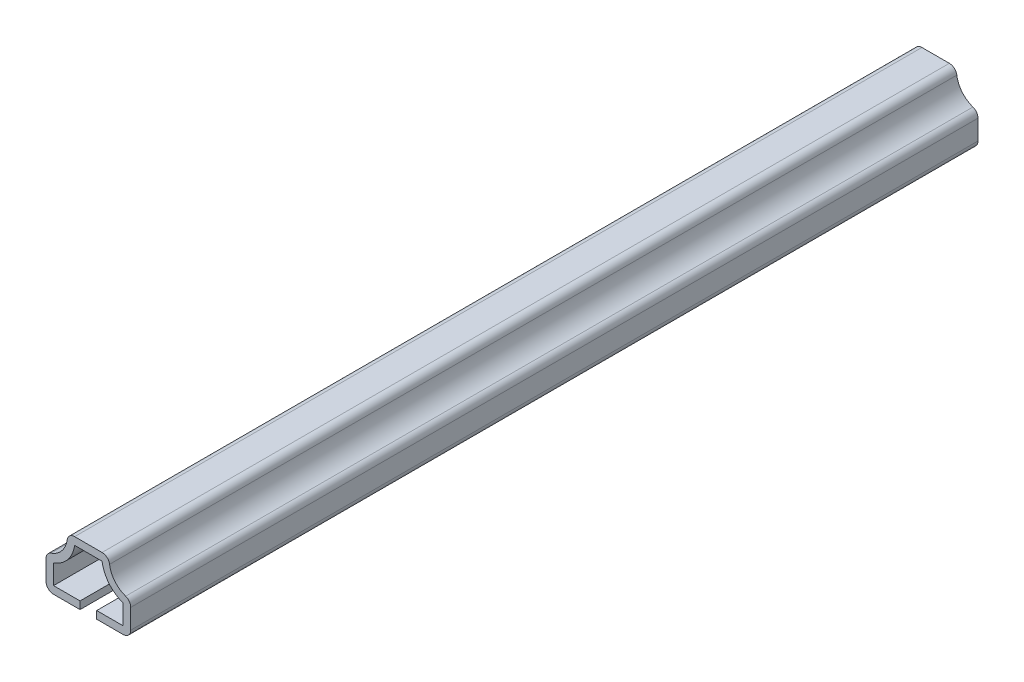
ISO-10303-21;
HEADER;
FILE_DESCRIPTION(('STEP AP214'),'2;1');
FILE_NAME('part.step','',(''),(''),'','','');
FILE_SCHEMA(('AUTOMOTIVE_DESIGN { 1 0 10303 214 1 1 1 1 }'));
ENDSEC;
DATA;
#1=APPLICATION_CONTEXT('core data for automotive mechanical design processes');
#2=APPLICATION_PROTOCOL_DEFINITION('international standard','automotive_design',2000,#1);
#3=PRODUCT_CONTEXT('',#1,'mechanical');
#4=PRODUCT('Part','Part','',(#3));
#5=PRODUCT_RELATED_PRODUCT_CATEGORY('part','',(#4));
#6=PRODUCT_DEFINITION_FORMATION('','',#4);
#7=PRODUCT_DEFINITION_CONTEXT('part definition',#1,'design');
#8=PRODUCT_DEFINITION('design','',#6,#7);
#9=PRODUCT_DEFINITION_SHAPE('','',#8);
#10=(LENGTH_UNIT() NAMED_UNIT(*) SI_UNIT(.MILLI.,.METRE.));
#11=(NAMED_UNIT(*) PLANE_ANGLE_UNIT() SI_UNIT($,.RADIAN.));
#12=(NAMED_UNIT(*) SI_UNIT($,.STERADIAN.) SOLID_ANGLE_UNIT());
#13=UNCERTAINTY_MEASURE_WITH_UNIT(LENGTH_MEASURE(1.E-05),#10,'distance_accuracy_value','');
#14=(GEOMETRIC_REPRESENTATION_CONTEXT(3) GLOBAL_UNCERTAINTY_ASSIGNED_CONTEXT((#13)) GLOBAL_UNIT_ASSIGNED_CONTEXT((#10,
#11,#12)) REPRESENTATION_CONTEXT('',''));
#15=CARTESIAN_POINT('',(0.,0.,0.));
#16=DIRECTION('',(0.,0.,1.));
#17=DIRECTION('',(1.,0.,0.));
#18=AXIS2_PLACEMENT_3D('',#15,#16,#17);
#19=CARTESIAN_POINT('',(11.1125,1.9812,-222.25));
#20=DIRECTION('',(0.,1.,0.));
#21=DIRECTION('',(-1.,0.,0.));
#22=AXIS2_PLACEMENT_3D('',#19,#20,#21);
#23=PLANE('',#22);
#24=DIRECTION('',(-1.,0.,0.));
#25=VECTOR('',#24,1.);
#26=CARTESIAN_POINT('',(11.1125,1.9812,0.));
#27=LINE('',#26,#25);
#28=CARTESIAN_POINT('',(9.1313,1.9812,0.));
#29=VERTEX_POINT('',#28);
#30=CARTESIAN_POINT('',(2.1844,1.9812,0.));
#31=VERTEX_POINT('',#30);
#32=EDGE_CURVE('E250',#29,#31,#27,.T.);
#33=ORIENTED_EDGE('',*,*,#32,.F.);
#34=DIRECTION('',(0.,0.,1.));
#35=VECTOR('',#34,1.);
#36=CARTESIAN_POINT('',(9.1313,1.9812,-222.25));
#37=LINE('',#36,#35);
#38=CARTESIAN_POINT('',(9.1313,1.9812,-222.25));
#39=VERTEX_POINT('',#38);
#40=EDGE_CURVE('E208',#39,#29,#37,.T.);
#41=ORIENTED_EDGE('',*,*,#40,.F.);
#42=DIRECTION('',(-1.,0.,0.));
#43=VECTOR('',#42,1.);
#44=CARTESIAN_POINT('',(11.1125,1.9812,-222.25));
#45=LINE('',#44,#43);
#46=CARTESIAN_POINT('',(2.1844,1.9812,-222.25));
#47=VERTEX_POINT('',#46);
#48=EDGE_CURVE('E190',#39,#47,#45,.T.);
#49=ORIENTED_EDGE('',*,*,#48,.T.);
#50=DIRECTION('',(0.,0.,1.));
#51=VECTOR('',#50,1.);
#52=CARTESIAN_POINT('',(2.1844,1.9812,-222.25));
#53=LINE('',#52,#51);
#54=EDGE_CURVE('E198',#47,#31,#53,.T.);
#55=ORIENTED_EDGE('',*,*,#54,.T.);
#56=EDGE_LOOP('',(#33,#41,#49,#55));
#57=FACE_BOUND('',#56,.T.);
#58=ADVANCED_FACE('F35',(#57),#23,.T.);
#59=CARTESIAN_POINT('',(9.1313,8.73125,-222.25));
#60=DIRECTION('',(-1.,0.,0.));
#61=DIRECTION('',(0.,0.,1.));
#62=AXIS2_PLACEMENT_3D('',#59,#60,#61);
#63=PLANE('',#62);
#64=DIRECTION('',(0.,1.,0.));
#65=VECTOR('',#64,1.);
#66=CARTESIAN_POINT('',(9.1313,8.73125,0.));
#67=LINE('',#66,#65);
#68=CARTESIAN_POINT('',(9.1313,7.16335255663206,0.));
#69=VERTEX_POINT('',#68);
#70=EDGE_CURVE('E209',#69,#29,#67,.F.);
#71=ORIENTED_EDGE('',*,*,#70,.F.);
#72=DIRECTION('',(0.,0.,1.));
#73=VECTOR('',#72,1.);
#74=CARTESIAN_POINT('',(9.1313,7.16335255663206,-222.25));
#75=LINE('',#74,#73);
#76=CARTESIAN_POINT('',(9.1313,7.16335255663206,-222.25));
#77=VERTEX_POINT('',#76);
#78=EDGE_CURVE('E290',#77,#69,#75,.T.);
#79=ORIENTED_EDGE('',*,*,#78,.F.);
#80=DIRECTION('',(0.,1.,0.));
#81=VECTOR('',#80,1.);
#82=CARTESIAN_POINT('',(9.1313,8.73125,-222.25));
#83=LINE('',#82,#81);
#84=EDGE_CURVE('E206',#77,#39,#83,.F.);
#85=ORIENTED_EDGE('',*,*,#84,.T.);
#86=ORIENTED_EDGE('',*,*,#40,.T.);
#87=EDGE_LOOP('',(#71,#79,#85,#86));
#88=FACE_BOUND('',#87,.T.);
#89=ADVANCED_FACE('F387',(#88),#63,.T.);
#90=CARTESIAN_POINT('',(11.8508687388177,15.0381756857471,-222.25));
#91=DIRECTION('',(0.,0.,1.));
#92=DIRECTION('',(1.,0.,0.));
#93=AXIS2_PLACEMENT_3D('',#90,#91,#92);
#94=CYLINDRICAL_SURFACE('',#93,8.3312);
#95=CARTESIAN_POINT('',(11.8508687388177,15.0381756857471,0.));
#96=DIRECTION('',(0.,0.,1.));
#97=DIRECTION('',(1.,0.,0.));
#98=AXIS2_PLACEMENT_3D('',#95,#96,#97);
#99=CIRCLE('',#98,8.3312);
#100=CARTESIAN_POINT('',(3.59863887472215,13.8938,0.));
#101=VERTEX_POINT('',#100);
#102=EDGE_CURVE('E212',#101,#69,#99,.T.);
#103=ORIENTED_EDGE('',*,*,#102,.F.);
#104=DIRECTION('',(0.,0.,1.));
#105=VECTOR('',#104,1.);
#106=CARTESIAN_POINT('',(3.59863887472215,13.8938,-222.25));
#107=LINE('',#106,#105);
#108=CARTESIAN_POINT('',(3.59863887472215,13.8938,-222.25));
#109=VERTEX_POINT('',#108);
#110=EDGE_CURVE('E292',#109,#101,#107,.T.);
#111=ORIENTED_EDGE('',*,*,#110,.F.);
#112=CARTESIAN_POINT('',(11.8508687388177,15.0381756857471,-222.25));
#113=DIRECTION('',(0.,0.,1.));
#114=DIRECTION('',(1.,0.,0.));
#115=AXIS2_PLACEMENT_3D('',#112,#113,#114);
#116=CIRCLE('',#115,8.3312);
#117=EDGE_CURVE('E246',#109,#77,#116,.T.);
#118=ORIENTED_EDGE('',*,*,#117,.T.);
#119=ORIENTED_EDGE('',*,*,#78,.T.);
#120=EDGE_LOOP('',(#103,#111,#118,#119));
#121=FACE_BOUND('',#120,.T.);
#122=ADVANCED_FACE('F442',(#121),#94,.T.);
#123=CARTESIAN_POINT('',(5.55625,13.8938,-222.25));
#124=DIRECTION('',(0.,-1.,0.));
#125=DIRECTION('',(0.,0.,-1.));
#126=AXIS2_PLACEMENT_3D('',#123,#124,#125);
#127=PLANE('',#126);
#128=DIRECTION('',(1.,0.,0.));
#129=VECTOR('',#128,1.);
#130=CARTESIAN_POINT('',(5.55625,13.8938,0.));
#131=LINE('',#130,#129);
#132=CARTESIAN_POINT('',(-3.59863887472215,13.8938,0.));
#133=VERTEX_POINT('',#132);
#134=EDGE_CURVE('E283',#133,#101,#131,.T.);
#135=ORIENTED_EDGE('',*,*,#134,.F.);
#136=DIRECTION('',(0.,0.,1.));
#137=VECTOR('',#136,1.);
#138=CARTESIAN_POINT('',(-3.59863887472215,13.8938,-222.25));
#139=LINE('',#138,#137);
#140=CARTESIAN_POINT('',(-3.59863887472215,13.8938,-222.25));
#141=VERTEX_POINT('',#140);
#142=EDGE_CURVE('E294',#141,#133,#139,.T.);
#143=ORIENTED_EDGE('',*,*,#142,.F.);
#144=DIRECTION('',(1.,0.,0.));
#145=VECTOR('',#144,1.);
#146=CARTESIAN_POINT('',(5.55625,13.8938,-222.25));
#147=LINE('',#146,#145);
#148=EDGE_CURVE('E243',#141,#109,#147,.T.);
#149=ORIENTED_EDGE('',*,*,#148,.T.);
#150=ORIENTED_EDGE('',*,*,#110,.T.);
#151=EDGE_LOOP('',(#135,#143,#149,#150));
#152=FACE_BOUND('',#151,.T.);
#153=ADVANCED_FACE('F394',(#152),#127,.T.);
#154=CARTESIAN_POINT('',(-11.8508687388177,15.0381756857471,-222.25));
#155=DIRECTION('',(0.,0.,1.));
#156=DIRECTION('',(1.,0.,0.));
#157=AXIS2_PLACEMENT_3D('',#154,#155,#156);
#158=CYLINDRICAL_SURFACE('',#157,8.3312);
#159=CARTESIAN_POINT('',(-11.8508687388177,15.0381756857471,0.));
#160=DIRECTION('',(0.,0.,1.));
#161=DIRECTION('',(1.,0.,0.));
#162=AXIS2_PLACEMENT_3D('',#159,#160,#161);
#163=CIRCLE('',#162,8.3312);
#164=CARTESIAN_POINT('',(-9.1313,7.16335255663206,0.));
#165=VERTEX_POINT('',#164);
#166=EDGE_CURVE('E280',#165,#133,#163,.T.);
#167=ORIENTED_EDGE('',*,*,#166,.F.);
#168=DIRECTION('',(0.,0.,1.));
#169=VECTOR('',#168,1.);
#170=CARTESIAN_POINT('',(-9.1313,7.16335255663206,-222.25));
#171=LINE('',#170,#169);
#172=CARTESIAN_POINT('',(-9.1313,7.16335255663206,-222.25));
#173=VERTEX_POINT('',#172);
#174=EDGE_CURVE('E296',#173,#165,#171,.T.);
#175=ORIENTED_EDGE('',*,*,#174,.F.);
#176=CARTESIAN_POINT('',(-11.8508687388177,15.0381756857471,-222.25));
#177=DIRECTION('',(0.,0.,1.));
#178=DIRECTION('',(1.,0.,0.));
#179=AXIS2_PLACEMENT_3D('',#176,#177,#178);
#180=CIRCLE('',#179,8.3312);
#181=EDGE_CURVE('E240',#173,#141,#180,.T.);
#182=ORIENTED_EDGE('',*,*,#181,.T.);
#183=ORIENTED_EDGE('',*,*,#142,.T.);
#184=EDGE_LOOP('',(#167,#175,#182,#183));
#185=FACE_BOUND('',#184,.T.);
#186=ADVANCED_FACE('F397',(#185),#158,.T.);
#187=CARTESIAN_POINT('',(-9.1313,8.73125,-222.25));
#188=DIRECTION('',(1.,0.,0.));
#189=DIRECTION('',(0.,0.,-1.));
#190=AXIS2_PLACEMENT_3D('',#187,#188,#189);
#191=PLANE('',#190);
#192=DIRECTION('',(0.,1.,0.));
#193=VECTOR('',#192,1.);
#194=CARTESIAN_POINT('',(-9.1313,8.73125,0.));
#195=LINE('',#194,#193);
#196=CARTESIAN_POINT('',(-9.1313,1.9812,0.));
#197=VERTEX_POINT('',#196);
#198=EDGE_CURVE('E277',#197,#165,#195,.T.);
#199=ORIENTED_EDGE('',*,*,#198,.F.);
#200=DIRECTION('',(0.,0.,1.));
#201=VECTOR('',#200,1.);
#202=CARTESIAN_POINT('',(-9.1313,1.9812,-222.25));
#203=LINE('',#202,#201);
#204=CARTESIAN_POINT('',(-9.1313,1.9812,-222.25));
#205=VERTEX_POINT('',#204);
#206=EDGE_CURVE('E298',#205,#197,#203,.T.);
#207=ORIENTED_EDGE('',*,*,#206,.F.);
#208=DIRECTION('',(0.,1.,0.));
#209=VECTOR('',#208,1.);
#210=CARTESIAN_POINT('',(-9.1313,8.73125,-222.25));
#211=LINE('',#210,#209);
#212=EDGE_CURVE('E237',#205,#173,#211,.T.);
#213=ORIENTED_EDGE('',*,*,#212,.T.);
#214=ORIENTED_EDGE('',*,*,#174,.T.);
#215=EDGE_LOOP('',(#199,#207,#213,#214));
#216=FACE_BOUND('',#215,.T.);
#217=ADVANCED_FACE('F402',(#216),#191,.T.);
#218=CARTESIAN_POINT('',(-11.1125,1.9812,-222.25));
#219=DIRECTION('',(0.,1.,0.));
#220=DIRECTION('',(-1.,0.,0.));
#221=AXIS2_PLACEMENT_3D('',#218,#219,#220);
#222=PLANE('',#221);
#223=DIRECTION('',(-1.,0.,0.));
#224=VECTOR('',#223,1.);
#225=CARTESIAN_POINT('',(-11.1125,1.9812,0.));
#226=LINE('',#225,#224);
#227=CARTESIAN_POINT('',(-2.1844,1.9812,0.));
#228=VERTEX_POINT('',#227);
#229=EDGE_CURVE('E274',#228,#197,#226,.T.);
#230=ORIENTED_EDGE('',*,*,#229,.F.);
#231=DIRECTION('',(0.,0.,1.));
#232=VECTOR('',#231,1.);
#233=CARTESIAN_POINT('',(-2.1844,1.9812,-222.25));
#234=LINE('',#233,#232);
#235=CARTESIAN_POINT('',(-2.1844,1.9812,-222.25));
#236=VERTEX_POINT('',#235);
#237=EDGE_CURVE('E300',#236,#228,#234,.T.);
#238=ORIENTED_EDGE('',*,*,#237,.F.);
#239=DIRECTION('',(-1.,0.,0.));
#240=VECTOR('',#239,1.);
#241=CARTESIAN_POINT('',(-11.1125,1.9812,-222.25));
#242=LINE('',#241,#240);
#243=EDGE_CURVE('E234',#236,#205,#242,.T.);
#244=ORIENTED_EDGE('',*,*,#243,.T.);
#245=ORIENTED_EDGE('',*,*,#206,.T.);
#246=EDGE_LOOP('',(#230,#238,#244,#245));
#247=FACE_BOUND('',#246,.T.);
#248=ADVANCED_FACE('F405',(#247),#222,.T.);
#249=CARTESIAN_POINT('',(-2.1844,1.9812,-222.25));
#250=DIRECTION('',(-1.,0.,0.));
#251=DIRECTION('',(0.,0.,1.));
#252=AXIS2_PLACEMENT_3D('',#249,#250,#251);
#253=PLANE('',#252);
#254=DIRECTION('',(0.,-1.,0.));
#255=VECTOR('',#254,1.);
#256=CARTESIAN_POINT('',(-2.1844,1.9812,0.));
#257=LINE('',#256,#255);
#258=CARTESIAN_POINT('',(-2.1844,0.,0.));
#259=VERTEX_POINT('',#258);
#260=EDGE_CURVE('E272',#228,#259,#257,.T.);
#261=ORIENTED_EDGE('',*,*,#260,.T.);
#262=DIRECTION('',(0.,0.,1.));
#263=VECTOR('',#262,1.);
#264=CARTESIAN_POINT('',(-2.1844,0.,-222.25));
#265=LINE('',#264,#263);
#266=CARTESIAN_POINT('',(-2.1844,0.,-222.25));
#267=VERTEX_POINT('',#266);
#268=EDGE_CURVE('E302',#267,#259,#265,.T.);
#269=ORIENTED_EDGE('',*,*,#268,.F.);
#270=DIRECTION('',(0.,-1.,0.));
#271=VECTOR('',#270,1.);
#272=CARTESIAN_POINT('',(-2.1844,1.9812,-222.25));
#273=LINE('',#272,#271);
#274=EDGE_CURVE('E232',#236,#267,#273,.T.);
#275=ORIENTED_EDGE('',*,*,#274,.F.);
#276=ORIENTED_EDGE('',*,*,#237,.T.);
#277=EDGE_LOOP('',(#261,#269,#275,#276));
#278=FACE_BOUND('',#277,.T.);
#279=ADVANCED_FACE('F411',(#278),#253,.F.);
#280=CARTESIAN_POINT('',(-11.1125,0.,-222.25));
#281=DIRECTION('',(0.,1.,0.));
#282=DIRECTION('',(-1.,0.,0.));
#283=AXIS2_PLACEMENT_3D('',#280,#281,#282);
#284=PLANE('',#283);
#285=DIRECTION('',(-1.,0.,0.));
#286=VECTOR('',#285,1.);
#287=CARTESIAN_POINT('',(-11.1125,0.,0.));
#288=LINE('',#287,#286);
#289=CARTESIAN_POINT('',(-9.1313,0.,0.));
#290=VERTEX_POINT('',#289);
#291=EDGE_CURVE('E269',#259,#290,#288,.T.);
#292=ORIENTED_EDGE('',*,*,#291,.T.);
#293=DIRECTION('',(0.,0.,1.));
#294=VECTOR('',#293,1.);
#295=CARTESIAN_POINT('',(-9.1313,0.,-222.25));
#296=LINE('',#295,#294);
#297=CARTESIAN_POINT('',(-9.1313,0.,-222.25));
#298=VERTEX_POINT('',#297);
#299=EDGE_CURVE('E338',#290,#298,#296,.F.);
#300=ORIENTED_EDGE('',*,*,#299,.T.);
#301=DIRECTION('',(-1.,0.,0.));
#302=VECTOR('',#301,1.);
#303=CARTESIAN_POINT('',(-11.1125,0.,-222.25));
#304=LINE('',#303,#302);
#305=EDGE_CURVE('E229',#267,#298,#304,.T.);
#306=ORIENTED_EDGE('',*,*,#305,.F.);
#307=ORIENTED_EDGE('',*,*,#268,.T.);
#308=EDGE_LOOP('',(#292,#300,#306,#307));
#309=FACE_BOUND('',#308,.T.);
#310=ADVANCED_FACE('F415',(#309),#284,.F.);
#311=CARTESIAN_POINT('',(-11.1125,8.73125,-222.25));
#312=DIRECTION('',(1.,0.,0.));
#313=DIRECTION('',(0.,0.,-1.));
#314=AXIS2_PLACEMENT_3D('',#311,#312,#313);
#315=PLANE('',#314);
#316=DIRECTION('',(0.,1.,0.));
#317=VECTOR('',#316,1.);
#318=CARTESIAN_POINT('',(-11.1125,8.73125,0.));
#319=LINE('',#318,#317);
#320=CARTESIAN_POINT('',(-11.1125,1.9812,0.));
#321=VERTEX_POINT('',#320);
#322=CARTESIAN_POINT('',(-11.1125,7.16335255663206,0.));
#323=VERTEX_POINT('',#322);
#324=EDGE_CURVE('E266',#321,#323,#319,.T.);
#325=ORIENTED_EDGE('',*,*,#324,.T.);
#326=DIRECTION('',(0.,0.,1.));
#327=VECTOR('',#326,1.);
#328=CARTESIAN_POINT('',(-11.1125,7.16335255663206,-222.25));
#329=LINE('',#328,#327);
#330=CARTESIAN_POINT('',(-11.1125,7.16335255663206,-222.25));
#331=VERTEX_POINT('',#330);
#332=EDGE_CURVE('E325',#323,#331,#329,.F.);
#333=ORIENTED_EDGE('',*,*,#332,.T.);
#334=DIRECTION('',(0.,1.,0.));
#335=VECTOR('',#334,1.);
#336=CARTESIAN_POINT('',(-11.1125,8.73125,-222.25));
#337=LINE('',#336,#335);
#338=CARTESIAN_POINT('',(-11.1125,1.9812,-222.25));
#339=VERTEX_POINT('',#338);
#340=EDGE_CURVE('E227',#339,#331,#337,.T.);
#341=ORIENTED_EDGE('',*,*,#340,.F.);
#342=DIRECTION('',(0.,0.,1.));
#343=VECTOR('',#342,1.);
#344=CARTESIAN_POINT('',(-11.1125,1.9812,-222.25));
#345=LINE('',#344,#343);
#346=EDGE_CURVE('E322',#339,#321,#345,.T.);
#347=ORIENTED_EDGE('',*,*,#346,.T.);
#348=EDGE_LOOP('',(#325,#333,#341,#347));
#349=FACE_BOUND('',#348,.T.);
#350=ADVANCED_FACE('F423',(#349),#315,.F.);
#351=CARTESIAN_POINT('',(-11.8508687388177,15.0381756857471,-222.25));
#352=DIRECTION('',(0.,0.,1.));
#353=DIRECTION('',(1.,0.,0.));
#354=AXIS2_PLACEMENT_3D('',#351,#352,#353);
#355=CYLINDRICAL_SURFACE('',#354,6.35);
#356=CARTESIAN_POINT('',(-11.8508687388177,15.0381756857471,-222.25));
#357=DIRECTION('',(0.,0.,1.));
#358=DIRECTION('',(-1.,0.,0.));
#359=AXIS2_PLACEMENT_3D('',#356,#357,#358);
#360=CIRCLE('',#359,6.35);
#361=CARTESIAN_POINT('',(-9.77802671227982,9.03602391050698,-222.25));
#362=VERTEX_POINT('',#361);
#363=CARTESIAN_POINT('',(-5.5610593911839,14.1659381203911,-222.25));
#364=VERTEX_POINT('',#363);
#365=EDGE_CURVE('E224',#362,#364,#360,.T.);
#366=ORIENTED_EDGE('',*,*,#365,.F.);
#367=DIRECTION('',(0.,0.,1.));
#368=VECTOR('',#367,1.);
#369=CARTESIAN_POINT('',(-9.77802671227982,9.03602391050698,-222.25));
#370=LINE('',#369,#368);
#371=CARTESIAN_POINT('',(-9.77802671227982,9.03602391050698,0.));
#372=VERTEX_POINT('',#371);
#373=EDGE_CURVE('E307',#362,#372,#370,.T.);
#374=ORIENTED_EDGE('',*,*,#373,.T.);
#375=CARTESIAN_POINT('',(-11.8508687388177,15.0381756857471,0.));
#376=DIRECTION('',(0.,0.,1.));
#377=DIRECTION('',(-1.,0.,0.));
#378=AXIS2_PLACEMENT_3D('',#375,#376,#377);
#379=CIRCLE('',#378,6.35);
#380=CARTESIAN_POINT('',(-5.5610593911839,14.1659381203911,0.));
#381=VERTEX_POINT('',#380);
#382=EDGE_CURVE('E263',#372,#381,#379,.T.);
#383=ORIENTED_EDGE('',*,*,#382,.T.);
#384=DIRECTION('',(0.,0.,1.));
#385=VECTOR('',#384,1.);
#386=CARTESIAN_POINT('',(-5.5610593911839,14.1659381203911,-222.25));
#387=LINE('',#386,#385);
#388=EDGE_CURVE('E289',#381,#364,#387,.F.);
#389=ORIENTED_EDGE('',*,*,#388,.T.);
#390=EDGE_LOOP('',(#366,#374,#383,#389));
#391=FACE_BOUND('',#390,.T.);
#392=ADVANCED_FACE('F431',(#391),#355,.F.);
#393=CARTESIAN_POINT('',(5.55625,15.875,-222.25));
#394=DIRECTION('',(0.,-1.,0.));
#395=DIRECTION('',(0.,0.,-1.));
#396=AXIS2_PLACEMENT_3D('',#393,#394,#395);
#397=PLANE('',#396);
#398=DIRECTION('',(1.,0.,0.));
#399=VECTOR('',#398,1.);
#400=CARTESIAN_POINT('',(5.55625,15.875,0.));
#401=LINE('',#400,#399);
#402=CARTESIAN_POINT('',(-3.59863887472215,15.875,0.));
#403=VERTEX_POINT('',#402);
#404=CARTESIAN_POINT('',(3.59863887472215,15.875,0.));
#405=VERTEX_POINT('',#404);
#406=EDGE_CURVE('E260',#403,#405,#401,.T.);
#407=ORIENTED_EDGE('',*,*,#406,.T.);
#408=DIRECTION('',(0.,0.,1.));
#409=VECTOR('',#408,1.);
#410=CARTESIAN_POINT('',(3.59863887472215,15.875,-222.25));
#411=LINE('',#410,#409);
#412=CARTESIAN_POINT('',(3.59863887472215,15.875,-222.25));
#413=VERTEX_POINT('',#412);
#414=EDGE_CURVE('E11',#405,#413,#411,.F.);
#415=ORIENTED_EDGE('',*,*,#414,.T.);
#416=DIRECTION('',(1.,0.,0.));
#417=VECTOR('',#416,1.);
#418=CARTESIAN_POINT('',(5.55625,15.875,-222.25));
#419=LINE('',#418,#417);
#420=CARTESIAN_POINT('',(-3.59863887472215,15.875,-222.25));
#421=VERTEX_POINT('',#420);
#422=EDGE_CURVE('E221',#421,#413,#419,.T.);
#423=ORIENTED_EDGE('',*,*,#422,.F.);
#424=DIRECTION('',(0.,0.,1.));
#425=VECTOR('',#424,1.);
#426=CARTESIAN_POINT('',(-3.59863887472215,15.875,-222.25));
#427=LINE('',#426,#425);
#428=EDGE_CURVE('E43',#421,#403,#427,.T.);
#429=ORIENTED_EDGE('',*,*,#428,.T.);
#430=EDGE_LOOP('',(#407,#415,#423,#429));
#431=FACE_BOUND('',#430,.T.);
#432=ADVANCED_FACE('F356',(#431),#397,.F.);
#433=CARTESIAN_POINT('',(11.8508687388177,15.0381756857471,-222.25));
#434=DIRECTION('',(0.,0.,1.));
#435=DIRECTION('',(1.,0.,0.));
#436=AXIS2_PLACEMENT_3D('',#433,#434,#435);
#437=CYLINDRICAL_SURFACE('',#436,6.35);
#438=CARTESIAN_POINT('',(11.8508687388177,15.0381756857471,0.));
#439=DIRECTION('',(0.,0.,1.));
#440=DIRECTION('',(1.,0.,0.));
#441=AXIS2_PLACEMENT_3D('',#438,#439,#440);
#442=CIRCLE('',#441,6.35);
#443=CARTESIAN_POINT('',(5.5610593911839,14.1659381203911,0.));
#444=VERTEX_POINT('',#443);
#445=CARTESIAN_POINT('',(9.77802671227982,9.03602391050698,0.));
#446=VERTEX_POINT('',#445);
#447=EDGE_CURVE('E257',#444,#446,#442,.T.);
#448=ORIENTED_EDGE('',*,*,#447,.T.);
#449=DIRECTION('',(0.,0.,1.));
#450=VECTOR('',#449,1.);
#451=CARTESIAN_POINT('',(9.77802671227982,9.03602391050698,-222.25));
#452=LINE('',#451,#450);
#453=CARTESIAN_POINT('',(9.77802671227982,9.03602391050698,-222.25));
#454=VERTEX_POINT('',#453);
#455=EDGE_CURVE('E350',#446,#454,#452,.F.);
#456=ORIENTED_EDGE('',*,*,#455,.T.);
#457=CARTESIAN_POINT('',(11.8508687388177,15.0381756857471,-222.25));
#458=DIRECTION('',(0.,0.,1.));
#459=DIRECTION('',(1.,0.,0.));
#460=AXIS2_PLACEMENT_3D('',#457,#458,#459);
#461=CIRCLE('',#460,6.35);
#462=CARTESIAN_POINT('',(5.5610593911839,14.1659381203911,-222.25));
#463=VERTEX_POINT('',#462);
#464=EDGE_CURVE('E218',#463,#454,#461,.T.);
#465=ORIENTED_EDGE('',*,*,#464,.F.);
#466=DIRECTION('',(0.,0.,1.));
#467=VECTOR('',#466,1.);
#468=CARTESIAN_POINT('',(5.5610593911839,14.1659381203911,-222.25));
#469=LINE('',#468,#467);
#470=EDGE_CURVE('E347',#463,#444,#469,.T.);
#471=ORIENTED_EDGE('',*,*,#470,.T.);
#472=EDGE_LOOP('',(#448,#456,#465,#471));
#473=FACE_BOUND('',#472,.T.);
#474=ADVANCED_FACE('F370',(#473),#437,.F.);
#475=CARTESIAN_POINT('',(11.1125,8.73125,-222.25));
#476=DIRECTION('',(-1.,0.,0.));
#477=DIRECTION('',(0.,0.,1.));
#478=AXIS2_PLACEMENT_3D('',#475,#476,#477);
#479=PLANE('',#478);
#480=DIRECTION('',(0.,-1.,0.));
#481=VECTOR('',#480,1.);
#482=CARTESIAN_POINT('',(11.1125,8.73125,0.));
#483=LINE('',#482,#481);
#484=CARTESIAN_POINT('',(11.1125,7.16335255663206,0.));
#485=VERTEX_POINT('',#484);
#486=CARTESIAN_POINT('',(11.1125,1.9812,0.));
#487=VERTEX_POINT('',#486);
#488=EDGE_CURVE('E255',#485,#487,#483,.T.);
#489=ORIENTED_EDGE('',*,*,#488,.T.);
#490=DIRECTION('',(0.,0.,1.));
#491=VECTOR('',#490,1.);
#492=CARTESIAN_POINT('',(11.1125,1.9812,-222.25));
#493=LINE('',#492,#491);
#494=CARTESIAN_POINT('',(11.1125,1.9812,-222.25));
#495=VERTEX_POINT('',#494);
#496=EDGE_CURVE('E58',#487,#495,#493,.F.);
#497=ORIENTED_EDGE('',*,*,#496,.T.);
#498=DIRECTION('',(0.,-1.,0.));
#499=VECTOR('',#498,1.);
#500=CARTESIAN_POINT('',(11.1125,8.73125,-222.25));
#501=LINE('',#500,#499);
#502=CARTESIAN_POINT('',(11.1125,7.16335255663206,-222.25));
#503=VERTEX_POINT('',#502);
#504=EDGE_CURVE('E216',#503,#495,#501,.T.);
#505=ORIENTED_EDGE('',*,*,#504,.F.);
#506=DIRECTION('',(0.,0.,1.));
#507=VECTOR('',#506,1.);
#508=CARTESIAN_POINT('',(11.1125,7.16335255663206,-222.25));
#509=LINE('',#508,#507);
#510=EDGE_CURVE('E343',#503,#485,#509,.T.);
#511=ORIENTED_EDGE('',*,*,#510,.T.);
#512=EDGE_LOOP('',(#489,#497,#505,#511));
#513=FACE_BOUND('',#512,.T.);
#514=ADVANCED_FACE('F377',(#513),#479,.F.);
#515=CARTESIAN_POINT('',(11.1125,0.,-222.25));
#516=DIRECTION('',(0.,1.,0.));
#517=DIRECTION('',(-1.,0.,0.));
#518=AXIS2_PLACEMENT_3D('',#515,#516,#517);
#519=PLANE('',#518);
#520=DIRECTION('',(-1.,0.,0.));
#521=VECTOR('',#520,1.);
#522=CARTESIAN_POINT('',(11.1125,0.,-222.25));
#523=LINE('',#522,#521);
#524=CARTESIAN_POINT('',(9.1313,0.,-222.25));
#525=VERTEX_POINT('',#524);
#526=CARTESIAN_POINT('',(2.1844,0.,-222.25));
#527=VERTEX_POINT('',#526);
#528=EDGE_CURVE('E192',#525,#527,#523,.T.);
#529=ORIENTED_EDGE('',*,*,#528,.F.);
#530=DIRECTION('',(0.,0.,1.));
#531=VECTOR('',#530,1.);
#532=CARTESIAN_POINT('',(9.1313,0.,-222.25));
#533=LINE('',#532,#531);
#534=CARTESIAN_POINT('',(9.1313,0.,0.));
#535=VERTEX_POINT('',#534);
#536=EDGE_CURVE('E340',#525,#535,#533,.T.);
#537=ORIENTED_EDGE('',*,*,#536,.T.);
#538=DIRECTION('',(-1.,0.,0.));
#539=VECTOR('',#538,1.);
#540=CARTESIAN_POINT('',(11.1125,0.,0.));
#541=LINE('',#540,#539);
#542=CARTESIAN_POINT('',(2.1844,0.,0.));
#543=VERTEX_POINT('',#542);
#544=EDGE_CURVE('E253',#535,#543,#541,.T.);
#545=ORIENTED_EDGE('',*,*,#544,.T.);
#546=DIRECTION('',(0.,0.,1.));
#547=VECTOR('',#546,1.);
#548=CARTESIAN_POINT('',(2.1844,0.,-222.25));
#549=LINE('',#548,#547);
#550=EDGE_CURVE('E205',#527,#543,#549,.T.);
#551=ORIENTED_EDGE('',*,*,#550,.F.);
#552=EDGE_LOOP('',(#529,#537,#545,#551));
#553=FACE_BOUND('',#552,.T.);
#554=ADVANCED_FACE('F383',(#553),#519,.F.);
#555=CARTESIAN_POINT('',(2.1844,0.,-222.25));
#556=DIRECTION('',(1.,0.,0.));
#557=DIRECTION('',(0.,0.,-1.));
#558=AXIS2_PLACEMENT_3D('',#555,#556,#557);
#559=PLANE('',#558);
#560=DIRECTION('',(0.,1.,0.));
#561=VECTOR('',#560,1.);
#562=CARTESIAN_POINT('',(2.1844,0.,0.));
#563=LINE('',#562,#561);
#564=EDGE_CURVE('E201',#543,#31,#563,.T.);
#565=ORIENTED_EDGE('',*,*,#564,.T.);
#566=ORIENTED_EDGE('',*,*,#54,.F.);
#567=DIRECTION('',(0.,1.,0.));
#568=VECTOR('',#567,1.);
#569=CARTESIAN_POINT('',(2.1844,0.,-222.25));
#570=LINE('',#569,#568);
#571=EDGE_CURVE('E184',#527,#47,#570,.T.);
#572=ORIENTED_EDGE('',*,*,#571,.F.);
#573=ORIENTED_EDGE('',*,*,#550,.T.);
#574=EDGE_LOOP('',(#565,#566,#572,#573));
#575=FACE_BOUND('',#574,.T.);
#576=ADVANCED_FACE('F199',(#575),#559,.F.);
#577=CARTESIAN_POINT('',(11.8508687388177,15.0381756857471,-222.25));
#578=DIRECTION('',(0.,0.,1.));
#579=DIRECTION('',(1.,0.,0.));
#580=AXIS2_PLACEMENT_3D('',#577,#578,#579);
#581=PLANE('',#580);
#582=ORIENTED_EDGE('',*,*,#340,.T.);
#583=CARTESIAN_POINT('',(-9.1313,7.16335255663206,-222.25));
#584=DIRECTION('',(0.,0.,1.));
#585=DIRECTION('',(1.,0.,0.));
#586=AXIS2_PLACEMENT_3D('',#583,#584,#585);
#587=CIRCLE('',#586,1.9812);
#588=EDGE_CURVE('E336',#331,#362,#587,.F.);
#589=ORIENTED_EDGE('',*,*,#588,.T.);
#590=ORIENTED_EDGE('',*,*,#365,.T.);
#591=CARTESIAN_POINT('',(-3.59863887472215,13.8938,-222.25));
#592=DIRECTION('',(0.,0.,1.));
#593=DIRECTION('',(1.,0.,0.));
#594=AXIS2_PLACEMENT_3D('',#591,#592,#593);
#595=CIRCLE('',#594,1.9812);
#596=EDGE_CURVE('E327',#364,#421,#595,.F.);
#597=ORIENTED_EDGE('',*,*,#596,.T.);
#598=ORIENTED_EDGE('',*,*,#422,.T.);
#599=CARTESIAN_POINT('',(3.59863887472215,13.8938,-222.25));
#600=DIRECTION('',(0.,0.,1.));
#601=DIRECTION('',(1.,0.,0.));
#602=AXIS2_PLACEMENT_3D('',#599,#600,#601);
#603=CIRCLE('',#602,1.9812);
#604=EDGE_CURVE('E329',#413,#463,#603,.F.);
#605=ORIENTED_EDGE('',*,*,#604,.T.);
#606=ORIENTED_EDGE('',*,*,#464,.T.);
#607=CARTESIAN_POINT('',(9.1313,7.16335255663206,-222.25));
#608=DIRECTION('',(0.,0.,1.));
#609=DIRECTION('',(1.,0.,0.));
#610=AXIS2_PLACEMENT_3D('',#607,#608,#609);
#611=CIRCLE('',#610,1.9812);
#612=EDGE_CURVE('E331',#454,#503,#611,.F.);
#613=ORIENTED_EDGE('',*,*,#612,.T.);
#614=ORIENTED_EDGE('',*,*,#504,.T.);
#615=CARTESIAN_POINT('',(9.1313,1.9812,-222.25));
#616=DIRECTION('',(0.,0.,1.));
#617=DIRECTION('',(1.,0.,0.));
#618=AXIS2_PLACEMENT_3D('',#615,#616,#617);
#619=CIRCLE('',#618,1.9812);
#620=EDGE_CURVE('E50',#495,#525,#619,.F.);
#621=ORIENTED_EDGE('',*,*,#620,.T.);
#622=ORIENTED_EDGE('',*,*,#528,.T.);
#623=ORIENTED_EDGE('',*,*,#571,.T.);
#624=ORIENTED_EDGE('',*,*,#48,.F.);
#625=ORIENTED_EDGE('',*,*,#84,.F.);
#626=ORIENTED_EDGE('',*,*,#117,.F.);
#627=ORIENTED_EDGE('',*,*,#148,.F.);
#628=ORIENTED_EDGE('',*,*,#181,.F.);
#629=ORIENTED_EDGE('',*,*,#212,.F.);
#630=ORIENTED_EDGE('',*,*,#243,.F.);
#631=ORIENTED_EDGE('',*,*,#274,.T.);
#632=ORIENTED_EDGE('',*,*,#305,.T.);
#633=CARTESIAN_POINT('',(-9.1313,1.9812,-222.25));
#634=DIRECTION('',(0.,0.,1.));
#635=DIRECTION('',(1.,0.,0.));
#636=AXIS2_PLACEMENT_3D('',#633,#634,#635);
#637=CIRCLE('',#636,1.9812);
#638=EDGE_CURVE('E334',#298,#339,#637,.F.);
#639=ORIENTED_EDGE('',*,*,#638,.T.);
#640=EDGE_LOOP('',(#582,#589,#590,#597,#598,#605,#606,#613,#614,#621,#622,#623,#624,#625,#626,
#627,#628,#629,#630,#631,#632,#639));
#641=FACE_BOUND('',#640,.T.);
#642=ADVANCED_FACE('F187',(#641),#581,.F.);
#643=CARTESIAN_POINT('',(11.8508687388177,15.0381756857471,0.));
#644=DIRECTION('',(0.,0.,1.));
#645=DIRECTION('',(1.,0.,0.));
#646=AXIS2_PLACEMENT_3D('',#643,#644,#645);
#647=PLANE('',#646);
#648=ORIENTED_EDGE('',*,*,#382,.F.);
#649=CARTESIAN_POINT('',(-9.1313,7.16335255663206,0.));
#650=DIRECTION('',(0.,0.,1.));
#651=DIRECTION('',(1.,0.,0.));
#652=AXIS2_PLACEMENT_3D('',#649,#650,#651);
#653=CIRCLE('',#652,1.9812);
#654=EDGE_CURVE('E320',#372,#323,#653,.T.);
#655=ORIENTED_EDGE('',*,*,#654,.T.);
#656=ORIENTED_EDGE('',*,*,#324,.F.);
#657=CARTESIAN_POINT('',(-9.1313,1.9812,0.));
#658=DIRECTION('',(0.,0.,1.));
#659=DIRECTION('',(1.,0.,0.));
#660=AXIS2_PLACEMENT_3D('',#657,#658,#659);
#661=CIRCLE('',#660,1.9812);
#662=EDGE_CURVE('E318',#321,#290,#661,.T.);
#663=ORIENTED_EDGE('',*,*,#662,.T.);
#664=ORIENTED_EDGE('',*,*,#291,.F.);
#665=ORIENTED_EDGE('',*,*,#260,.F.);
#666=ORIENTED_EDGE('',*,*,#229,.T.);
#667=ORIENTED_EDGE('',*,*,#198,.T.);
#668=ORIENTED_EDGE('',*,*,#166,.T.);
#669=ORIENTED_EDGE('',*,*,#134,.T.);
#670=ORIENTED_EDGE('',*,*,#102,.T.);
#671=ORIENTED_EDGE('',*,*,#70,.T.);
#672=ORIENTED_EDGE('',*,*,#32,.T.);
#673=ORIENTED_EDGE('',*,*,#564,.F.);
#674=ORIENTED_EDGE('',*,*,#544,.F.);
#675=CARTESIAN_POINT('',(9.1313,1.9812,0.));
#676=DIRECTION('',(0.,0.,1.));
#677=DIRECTION('',(1.,0.,0.));
#678=AXIS2_PLACEMENT_3D('',#675,#676,#677);
#679=CIRCLE('',#678,1.9812);
#680=EDGE_CURVE('E316',#535,#487,#679,.T.);
#681=ORIENTED_EDGE('',*,*,#680,.T.);
#682=ORIENTED_EDGE('',*,*,#488,.F.);
#683=CARTESIAN_POINT('',(9.1313,7.16335255663206,0.));
#684=DIRECTION('',(0.,0.,1.));
#685=DIRECTION('',(1.,0.,0.));
#686=AXIS2_PLACEMENT_3D('',#683,#684,#685);
#687=CIRCLE('',#686,1.9812);
#688=EDGE_CURVE('E314',#485,#446,#687,.T.);
#689=ORIENTED_EDGE('',*,*,#688,.T.);
#690=ORIENTED_EDGE('',*,*,#447,.F.);
#691=CARTESIAN_POINT('',(3.59863887472215,13.8938,0.));
#692=DIRECTION('',(0.,0.,1.));
#693=DIRECTION('',(1.,0.,0.));
#694=AXIS2_PLACEMENT_3D('',#691,#692,#693);
#695=CIRCLE('',#694,1.9812);
#696=EDGE_CURVE('E312',#444,#405,#695,.T.);
#697=ORIENTED_EDGE('',*,*,#696,.T.);
#698=ORIENTED_EDGE('',*,*,#406,.F.);
#699=CARTESIAN_POINT('',(-3.59863887472215,13.8938,0.));
#700=DIRECTION('',(0.,0.,1.));
#701=DIRECTION('',(1.,0.,0.));
#702=AXIS2_PLACEMENT_3D('',#699,#700,#701);
#703=CIRCLE('',#702,1.9812);
#704=EDGE_CURVE('E310',#403,#381,#703,.T.);
#705=ORIENTED_EDGE('',*,*,#704,.T.);
#706=EDGE_LOOP('',(#648,#655,#656,#663,#664,#665,#666,#667,#668,#669,#670,#671,#672,#673,#674,
#681,#682,#689,#690,#697,#698,#705));
#707=FACE_BOUND('',#706,.T.);
#708=ADVANCED_FACE('F362',(#707),#647,.T.);
#709=CARTESIAN_POINT('',(-9.1313,7.16335255663206,-222.25));
#710=DIRECTION('',(0.,0.,1.));
#711=DIRECTION('',(1.,0.,0.));
#712=AXIS2_PLACEMENT_3D('',#709,#710,#711);
#713=CYLINDRICAL_SURFACE('',#712,1.9812);
#714=ORIENTED_EDGE('',*,*,#588,.F.);
#715=ORIENTED_EDGE('',*,*,#332,.F.);
#716=ORIENTED_EDGE('',*,*,#654,.F.);
#717=ORIENTED_EDGE('',*,*,#373,.F.);
#718=EDGE_LOOP('',(#714,#715,#716,#717));
#719=FACE_BOUND('',#718,.T.);
#720=ADVANCED_FACE('F427',(#719),#713,.T.);
#721=CARTESIAN_POINT('',(-9.1313,1.9812,-222.25));
#722=DIRECTION('',(0.,0.,1.));
#723=DIRECTION('',(1.,0.,0.));
#724=AXIS2_PLACEMENT_3D('',#721,#722,#723);
#725=CYLINDRICAL_SURFACE('',#724,1.9812);
#726=ORIENTED_EDGE('',*,*,#638,.F.);
#727=ORIENTED_EDGE('',*,*,#299,.F.);
#728=ORIENTED_EDGE('',*,*,#662,.F.);
#729=ORIENTED_EDGE('',*,*,#346,.F.);
#730=EDGE_LOOP('',(#726,#727,#728,#729));
#731=FACE_BOUND('',#730,.T.);
#732=ADVANCED_FACE('F418',(#731),#725,.T.);
#733=CARTESIAN_POINT('',(9.1313,1.9812,-222.25));
#734=DIRECTION('',(0.,0.,1.));
#735=DIRECTION('',(1.,0.,0.));
#736=AXIS2_PLACEMENT_3D('',#733,#734,#735);
#737=CYLINDRICAL_SURFACE('',#736,1.9812);
#738=ORIENTED_EDGE('',*,*,#620,.F.);
#739=ORIENTED_EDGE('',*,*,#496,.F.);
#740=ORIENTED_EDGE('',*,*,#680,.F.);
#741=ORIENTED_EDGE('',*,*,#536,.F.);
#742=EDGE_LOOP('',(#738,#739,#740,#741));
#743=FACE_BOUND('',#742,.T.);
#744=ADVANCED_FACE('F381',(#743),#737,.T.);
#745=CARTESIAN_POINT('',(9.1313,7.16335255663206,-222.25));
#746=DIRECTION('',(0.,0.,1.));
#747=DIRECTION('',(1.,0.,0.));
#748=AXIS2_PLACEMENT_3D('',#745,#746,#747);
#749=CYLINDRICAL_SURFACE('',#748,1.9812);
#750=ORIENTED_EDGE('',*,*,#612,.F.);
#751=ORIENTED_EDGE('',*,*,#455,.F.);
#752=ORIENTED_EDGE('',*,*,#688,.F.);
#753=ORIENTED_EDGE('',*,*,#510,.F.);
#754=EDGE_LOOP('',(#750,#751,#752,#753));
#755=FACE_BOUND('',#754,.T.);
#756=ADVANCED_FACE('F375',(#755),#749,.T.);
#757=CARTESIAN_POINT('',(3.59863887472215,13.8938,-222.25));
#758=DIRECTION('',(0.,0.,1.));
#759=DIRECTION('',(1.,0.,0.));
#760=AXIS2_PLACEMENT_3D('',#757,#758,#759);
#761=CYLINDRICAL_SURFACE('',#760,1.9812);
#762=ORIENTED_EDGE('',*,*,#604,.F.);
#763=ORIENTED_EDGE('',*,*,#414,.F.);
#764=ORIENTED_EDGE('',*,*,#696,.F.);
#765=ORIENTED_EDGE('',*,*,#470,.F.);
#766=EDGE_LOOP('',(#762,#763,#764,#765));
#767=FACE_BOUND('',#766,.T.);
#768=ADVANCED_FACE('F367',(#767),#761,.T.);
#769=CARTESIAN_POINT('',(-3.59863887472215,13.8938,-222.25));
#770=DIRECTION('',(0.,0.,1.));
#771=DIRECTION('',(1.,0.,0.));
#772=AXIS2_PLACEMENT_3D('',#769,#770,#771);
#773=CYLINDRICAL_SURFACE('',#772,1.9812);
#774=ORIENTED_EDGE('',*,*,#596,.F.);
#775=ORIENTED_EDGE('',*,*,#388,.F.);
#776=ORIENTED_EDGE('',*,*,#704,.F.);
#777=ORIENTED_EDGE('',*,*,#428,.F.);
#778=EDGE_LOOP('',(#774,#775,#776,#777));
#779=FACE_BOUND('',#778,.T.);
#780=ADVANCED_FACE('F37',(#779),#773,.T.);
#781=CLOSED_SHELL('',(#58,#89,#122,#153,#186,#217,#248,#279,#310,#350,#392,#432,#474,#514,#554,
#576,#642,#708,#720,#732,#744,#756,#768,#780));
#782=MANIFOLD_SOLID_BREP('B2',#781);
#783=ADVANCED_BREP_SHAPE_REPRESENTATION('',(#18,#782),#14);
#784=SHAPE_DEFINITION_REPRESENTATION(#9,#783);
ENDSEC;
END-ISO-10303-21;
